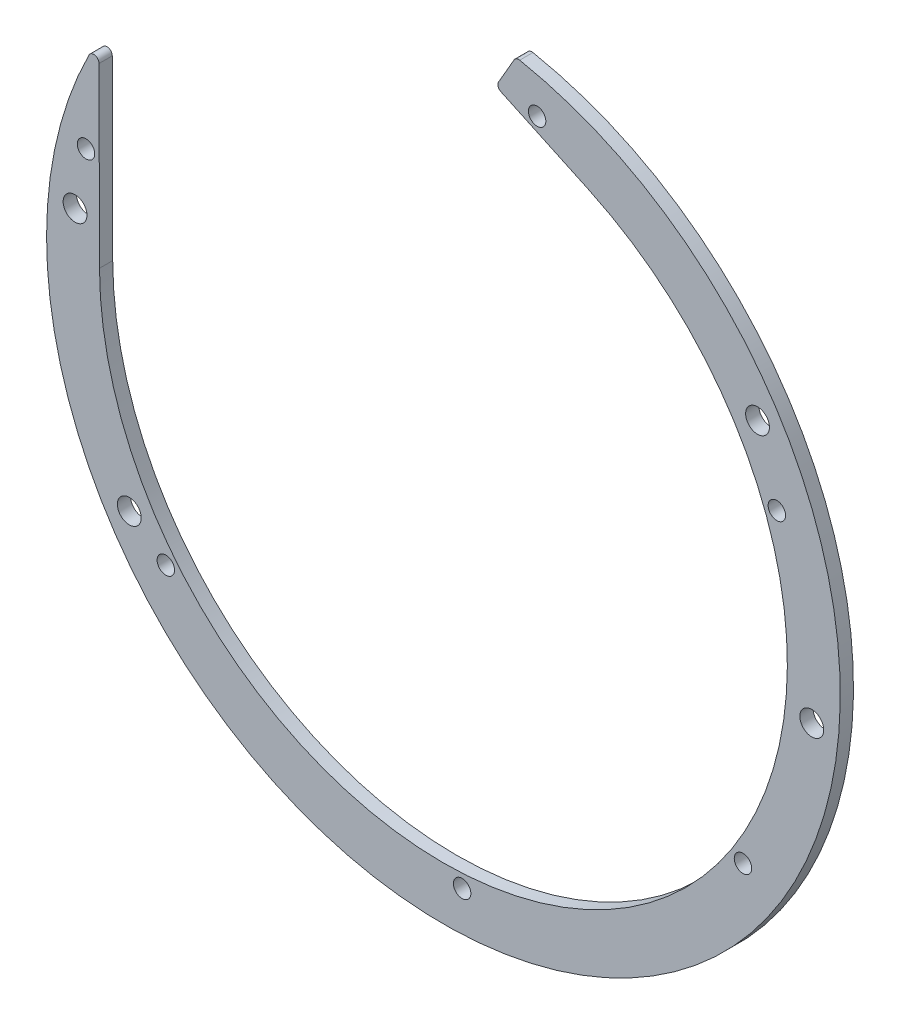
ISO-10303-21;
HEADER;
FILE_DESCRIPTION(('STEP AP214'),'2;1');
FILE_NAME('part.step','',(''),(''),'','','');
FILE_SCHEMA(('AUTOMOTIVE_DESIGN { 1 0 10303 214 1 1 1 1 }'));
ENDSEC;
DATA;
#1=APPLICATION_CONTEXT('core data for automotive mechanical design processes');
#2=APPLICATION_PROTOCOL_DEFINITION('international standard','automotive_design',2000,#1);
#3=PRODUCT_CONTEXT('',#1,'mechanical');
#4=PRODUCT('Part','Part','',(#3));
#5=PRODUCT_RELATED_PRODUCT_CATEGORY('part','',(#4));
#6=PRODUCT_DEFINITION_FORMATION('','',#4);
#7=PRODUCT_DEFINITION_CONTEXT('part definition',#1,'design');
#8=PRODUCT_DEFINITION('design','',#6,#7);
#9=PRODUCT_DEFINITION_SHAPE('','',#8);
#10=(LENGTH_UNIT() NAMED_UNIT(*) SI_UNIT(.MILLI.,.METRE.));
#11=(NAMED_UNIT(*) PLANE_ANGLE_UNIT() SI_UNIT($,.RADIAN.));
#12=(NAMED_UNIT(*) SI_UNIT($,.STERADIAN.) SOLID_ANGLE_UNIT());
#13=UNCERTAINTY_MEASURE_WITH_UNIT(LENGTH_MEASURE(1.E-05),#10,'distance_accuracy_value','');
#14=(GEOMETRIC_REPRESENTATION_CONTEXT(3) GLOBAL_UNCERTAINTY_ASSIGNED_CONTEXT((#13)) GLOBAL_UNIT_ASSIGNED_CONTEXT((#10,
#11,#12)) REPRESENTATION_CONTEXT('',''));
#15=CARTESIAN_POINT('',(0.,0.,0.));
#16=DIRECTION('',(0.,0.,1.));
#17=DIRECTION('',(1.,0.,0.));
#18=AXIS2_PLACEMENT_3D('',#15,#16,#17);
#19=CARTESIAN_POINT('',(27.4277530561864,147.471076358345,0.));
#20=DIRECTION('',(0.866025403784439,-0.5,0.));
#21=DIRECTION('',(-0.5,-0.866025403784439,0.));
#22=AXIS2_PLACEMENT_3D('',#19,#20,#21);
#23=PLANE('',#22);
#24=DIRECTION('',(0.,0.,-1.));
#25=VECTOR('',#24,1.);
#26=CARTESIAN_POINT('',(20.8671165029872,136.107720518211,0.));
#27=LINE('',#26,#25);
#28=CARTESIAN_POINT('',(20.8671165029872,136.107720518211,5.));
#29=VERTEX_POINT('',#28);
#30=CARTESIAN_POINT('',(20.8671165029872,136.107720518211,0.));
#31=VERTEX_POINT('',#30);
#32=EDGE_CURVE('E11',#29,#31,#27,.T.);
#33=ORIENTED_EDGE('',*,*,#32,.F.);
#34=DIRECTION('',(-0.5,-0.866025403784439,0.));
#35=VECTOR('',#34,1.);
#36=CARTESIAN_POINT('',(27.4277530561864,147.471076358345,5.));
#37=LINE('',#36,#35);
#38=CARTESIAN_POINT('',(26.7169808472667,146.239982779888,5.));
#39=VERTEX_POINT('',#38);
#40=EDGE_CURVE('E110',#39,#29,#37,.T.);
#41=ORIENTED_EDGE('',*,*,#40,.F.);
#42=DIRECTION('',(0.,0.,-1.));
#43=VECTOR('',#42,1.);
#44=CARTESIAN_POINT('',(26.7169808472667,146.239982779888,0.));
#45=LINE('',#44,#43);
#46=CARTESIAN_POINT('',(26.7169808472667,146.239982779888,0.));
#47=VERTEX_POINT('',#46);
#48=EDGE_CURVE('E53',#39,#47,#45,.T.);
#49=ORIENTED_EDGE('',*,*,#48,.T.);
#50=DIRECTION('',(-0.5,-0.866025403784439,0.));
#51=VECTOR('',#50,1.);
#52=CARTESIAN_POINT('',(27.4277530561864,147.471076358345,0.));
#53=LINE('',#52,#51);
#54=EDGE_CURVE('E162',#47,#31,#53,.T.);
#55=ORIENTED_EDGE('',*,*,#54,.T.);
#56=EDGE_LOOP('',(#33,#41,#49,#55));
#57=FACE_BOUND('',#56,.T.);
#58=ADVANCED_FACE('F43',(#57),#23,.F.);
#59=CARTESIAN_POINT('',(28.4490316548356,145.239982779888,0.));
#60=DIRECTION('',(0.,0.,-1.));
#61=DIRECTION('',(-1.,0.,0.));
#62=AXIS2_PLACEMENT_3D('',#59,#60,#61);
#63=CYLINDRICAL_SURFACE('',#62,2.);
#64=ORIENTED_EDGE('',*,*,#48,.F.);
#65=CARTESIAN_POINT('',(28.4490316548356,145.239982779888,5.));
#66=DIRECTION('',(0.,0.,-1.));
#67=DIRECTION('',(-1.,0.,0.));
#68=AXIS2_PLACEMENT_3D('',#65,#66,#67);
#69=CIRCLE('',#68,2.);
#70=CARTESIAN_POINT('',(28.8334780285495,147.202685249887,5.));
#71=VERTEX_POINT('',#70);
#72=EDGE_CURVE('E140',#39,#71,#69,.T.);
#73=ORIENTED_EDGE('',*,*,#72,.T.);
#74=DIRECTION('',(0.,0.,-1.));
#75=VECTOR('',#74,1.);
#76=CARTESIAN_POINT('',(28.8334780285495,147.202685249887,0.));
#77=LINE('',#76,#75);
#78=CARTESIAN_POINT('',(28.8334780285495,147.202685249887,0.));
#79=VERTEX_POINT('',#78);
#80=EDGE_CURVE('E155',#71,#79,#77,.T.);
#81=ORIENTED_EDGE('',*,*,#80,.T.);
#82=CARTESIAN_POINT('',(28.4490316548356,145.239982779888,0.));
#83=DIRECTION('',(0.,0.,-1.));
#84=DIRECTION('',(-1.,0.,0.));
#85=AXIS2_PLACEMENT_3D('',#82,#83,#84);
#86=CIRCLE('',#85,2.);
#87=EDGE_CURVE('E171',#47,#79,#86,.T.);
#88=ORIENTED_EDGE('',*,*,#87,.F.);
#89=EDGE_LOOP('',(#64,#73,#81,#88));
#90=FACE_BOUND('',#89,.T.);
#91=ADVANCED_FACE('F175',(#90),#63,.T.);
#92=CARTESIAN_POINT('',(0.,0.,0.));
#93=DIRECTION('',(0.,0.,-1.));
#94=DIRECTION('',(-1.,0.,0.));
#95=AXIS2_PLACEMENT_3D('',#92,#93,#94);
#96=CYLINDRICAL_SURFACE('',#95,150.);
#97=ORIENTED_EDGE('',*,*,#80,.F.);
#98=CARTESIAN_POINT('',(0.,0.,5.));
#99=DIRECTION('',(0.,0.,1.));
#100=DIRECTION('',(1.,0.,0.));
#101=AXIS2_PLACEMENT_3D('',#98,#99,#100);
#102=CIRCLE('',#101,150.);
#103=CARTESIAN_POINT('',(-133.953391528007,67.5017695926886,5.00000000000001));
#104=VERTEX_POINT('',#103);
#105=EDGE_CURVE('E136',#104,#71,#102,.T.);
#106=ORIENTED_EDGE('',*,*,#105,.F.);
#107=DIRECTION('',(0.,0.,-1.));
#108=VECTOR('',#107,1.);
#109=CARTESIAN_POINT('',(-133.953391528007,67.5017695926886,0.));
#110=LINE('',#109,#108);
#111=CARTESIAN_POINT('',(-133.953391528007,67.5017695926886,0.));
#112=VERTEX_POINT('',#111);
#113=EDGE_CURVE('E152',#104,#112,#110,.T.);
#114=ORIENTED_EDGE('',*,*,#113,.T.);
#115=CARTESIAN_POINT('',(0.,0.,0.));
#116=DIRECTION('',(0.,0.,1.));
#117=DIRECTION('',(-1.,0.,0.));
#118=AXIS2_PLACEMENT_3D('',#115,#116,#117);
#119=CIRCLE('',#118,150.);
#120=EDGE_CURVE('E177',#112,#79,#119,.T.);
#121=ORIENTED_EDGE('',*,*,#120,.T.);
#122=EDGE_LOOP('',(#97,#106,#114,#121));
#123=FACE_BOUND('',#122,.T.);
#124=ADVANCED_FACE('F252',(#123),#96,.T.);
#125=CARTESIAN_POINT('',(-132.167346307634,66.6017459981194,0.));
#126=DIRECTION('',(0.,0.,-1.));
#127=DIRECTION('',(-1.,0.,0.));
#128=AXIS2_PLACEMENT_3D('',#125,#126,#127);
#129=CYLINDRICAL_SURFACE('',#128,2.);
#130=ORIENTED_EDGE('',*,*,#113,.F.);
#131=CARTESIAN_POINT('',(-132.167346307634,66.6017459981194,5.));
#132=DIRECTION('',(0.,0.,-1.));
#133=DIRECTION('',(-1.,0.,0.));
#134=AXIS2_PLACEMENT_3D('',#131,#132,#133);
#135=CIRCLE('',#134,2.);
#136=CARTESIAN_POINT('',(-130.167352589726,66.6067588145679,5.00000000000001));
#137=VERTEX_POINT('',#136);
#138=EDGE_CURVE('E132',#104,#137,#135,.T.);
#139=ORIENTED_EDGE('',*,*,#138,.T.);
#140=DIRECTION('',(0.,0.,-1.));
#141=VECTOR('',#140,1.);
#142=CARTESIAN_POINT('',(-130.167352589726,66.6067588145679,0.));
#143=LINE('',#142,#141);
#144=CARTESIAN_POINT('',(-130.167352589726,66.6067588145679,0.));
#145=VERTEX_POINT('',#144);
#146=EDGE_CURVE('E149',#137,#145,#143,.T.);
#147=ORIENTED_EDGE('',*,*,#146,.T.);
#148=CARTESIAN_POINT('',(-132.167346307634,66.6017459981194,0.));
#149=DIRECTION('',(0.,0.,-1.));
#150=DIRECTION('',(-1.,0.,0.));
#151=AXIS2_PLACEMENT_3D('',#148,#149,#150);
#152=CIRCLE('',#151,2.);
#153=EDGE_CURVE('E181',#112,#145,#152,.T.);
#154=ORIENTED_EDGE('',*,*,#153,.F.);
#155=EDGE_LOOP('',(#130,#139,#147,#154));
#156=FACE_BOUND('',#155,.T.);
#157=ADVANCED_FACE('F257',(#156),#129,.T.);
#158=CARTESIAN_POINT('',(-130.187154080944,74.5070796119715,0.));
#159=DIRECTION('',(-0.999996858953974,-0.00250640822420056,0.));
#160=DIRECTION('',(-0.00250640822420056,0.999996858953974,0.));
#161=AXIS2_PLACEMENT_3D('',#158,#159,#160);
#162=PLANE('',#161);
#163=ORIENTED_EDGE('',*,*,#146,.F.);
#164=DIRECTION('',(-0.00250640822420056,0.999996858953974,0.));
#165=VECTOR('',#164,1.);
#166=CARTESIAN_POINT('',(-130.187154080944,74.5070796119715,5.));
#167=LINE('',#166,#165);
#168=CARTESIAN_POINT('',(-129.999591664017,-0.325833069146075,5.00000000000001));
#169=VERTEX_POINT('',#168);
#170=EDGE_CURVE('E128',#169,#137,#167,.T.);
#171=ORIENTED_EDGE('',*,*,#170,.F.);
#172=DIRECTION('',(0.,0.,-1.));
#173=VECTOR('',#172,1.);
#174=CARTESIAN_POINT('',(-129.999591664017,-0.325833069146075,0.));
#175=LINE('',#174,#173);
#176=CARTESIAN_POINT('',(-129.999591664017,-0.325833069146075,0.));
#177=VERTEX_POINT('',#176);
#178=EDGE_CURVE('E147',#169,#177,#175,.T.);
#179=ORIENTED_EDGE('',*,*,#178,.T.);
#180=DIRECTION('',(-0.00250640822420056,0.999996858953974,0.));
#181=VECTOR('',#180,1.);
#182=CARTESIAN_POINT('',(-130.187154080944,74.5070796119715,0.));
#183=LINE('',#182,#181);
#184=EDGE_CURVE('E188',#177,#145,#183,.T.);
#185=ORIENTED_EDGE('',*,*,#184,.T.);
#186=EDGE_LOOP('',(#163,#171,#179,#185));
#187=FACE_BOUND('',#186,.T.);
#188=ADVANCED_FACE('F261',(#187),#162,.F.);
#189=CARTESIAN_POINT('',(0.,0.,0.));
#190=DIRECTION('',(0.,0.,-1.));
#191=DIRECTION('',(-1.,0.,0.));
#192=AXIS2_PLACEMENT_3D('',#189,#190,#191);
#193=CYLINDRICAL_SURFACE('',#192,130.);
#194=ORIENTED_EDGE('',*,*,#178,.F.);
#195=CARTESIAN_POINT('',(0.,0.,5.));
#196=DIRECTION('',(0.,0.,-1.));
#197=DIRECTION('',(-1.,0.,0.));
#198=AXIS2_PLACEMENT_3D('',#195,#196,#197);
#199=CIRCLE('',#198,130.);
#200=CARTESIAN_POINT('',(54.940374026291,117.820012314764,5.));
#201=VERTEX_POINT('',#200);
#202=EDGE_CURVE('E124',#201,#169,#199,.T.);
#203=ORIENTED_EDGE('',*,*,#202,.F.);
#204=DIRECTION('',(0.,0.,-1.));
#205=VECTOR('',#204,1.);
#206=CARTESIAN_POINT('',(54.940374026291,117.820012314764,0.));
#207=LINE('',#206,#205);
#208=CARTESIAN_POINT('',(54.940374026291,117.820012314764,0.));
#209=VERTEX_POINT('',#208);
#210=EDGE_CURVE('E61',#201,#209,#207,.T.);
#211=ORIENTED_EDGE('',*,*,#210,.T.);
#212=CARTESIAN_POINT('',(0.,0.,0.));
#213=DIRECTION('',(0.,0.,-1.));
#214=DIRECTION('',(-1.,0.,0.));
#215=AXIS2_PLACEMENT_3D('',#212,#213,#214);
#216=CIRCLE('',#215,130.);
#217=EDGE_CURVE('E103',#209,#177,#216,.T.);
#218=ORIENTED_EDGE('',*,*,#217,.T.);
#219=EDGE_LOOP('',(#194,#203,#211,#218));
#220=FACE_BOUND('',#219,.T.);
#221=ADVANCED_FACE('F265',(#220),#193,.F.);
#222=CARTESIAN_POINT('',(54.940374026291,117.820012314764,0.));
#223=DIRECTION('',(0.4226182617407,0.90630778703665,0.));
#224=DIRECTION('',(0.90630778703665,-0.4226182617407,0.));
#225=AXIS2_PLACEMENT_3D('',#222,#223,#224);
#226=PLANE('',#225);
#227=ORIENTED_EDGE('',*,*,#210,.F.);
#228=DIRECTION('',(0.90630778703665,-0.4226182617407,0.));
#229=VECTOR('',#228,1.);
#230=CARTESIAN_POINT('',(54.940374026291,117.820012314764,4.99999999999994));
#231=LINE('',#230,#229);
#232=CARTESIAN_POINT('',(21.7539307870747,133.295104944137,5.));
#233=VERTEX_POINT('',#232);
#234=EDGE_CURVE('E108',#233,#201,#231,.T.);
#235=ORIENTED_EDGE('',*,*,#234,.F.);
#236=DIRECTION('',(0.,0.,-1.));
#237=VECTOR('',#236,1.);
#238=CARTESIAN_POINT('',(21.7539307870747,133.295104944137,0.));
#239=LINE('',#238,#237);
#240=CARTESIAN_POINT('',(21.7539307870747,133.295104944137,0.));
#241=VERTEX_POINT('',#240);
#242=EDGE_CURVE('E47',#233,#241,#239,.T.);
#243=ORIENTED_EDGE('',*,*,#242,.T.);
#244=DIRECTION('',(0.90630778703665,-0.4226182617407,0.));
#245=VECTOR('',#244,1.);
#246=CARTESIAN_POINT('',(54.940374026291,117.820012314764,0.));
#247=LINE('',#246,#245);
#248=EDGE_CURVE('E375',#241,#209,#247,.T.);
#249=ORIENTED_EDGE('',*,*,#248,.T.);
#250=EDGE_LOOP('',(#227,#235,#243,#249));
#251=FACE_BOUND('',#250,.T.);
#252=ADVANCED_FACE('F113',(#251),#226,.F.);
#253=CARTESIAN_POINT('',(-139.233065351558,14.633984857472,0.));
#254=DIRECTION('',(0.,0.,-1.));
#255=DIRECTION('',(-1.,0.,0.));
#256=AXIS2_PLACEMENT_3D('',#253,#254,#255);
#257=CYLINDRICAL_SURFACE('',#256,4.5);
#258=CARTESIAN_POINT('',(-139.233065351558,14.633984857472,0.));
#259=DIRECTION('',(0.,0.,-1.));
#260=DIRECTION('',(-1.,0.,0.));
#261=AXIS2_PLACEMENT_3D('',#258,#259,#260);
#262=CIRCLE('',#261,4.5);
#263=CARTESIAN_POINT('',(-143.733065351558,14.633984857472,0.));
#264=VERTEX_POINT('',#263);
#265=EDGE_CURVE('E127',#264,#264,#262,.T.);
#266=ORIENTED_EDGE('',*,*,#265,.T.);
#267=EDGE_LOOP('',(#266));
#268=FACE_BOUND('',#267,.T.);
#269=CARTESIAN_POINT('',(-139.233065351558,14.633984857472,5.));
#270=DIRECTION('',(0.,0.,-1.));
#271=DIRECTION('',(-1.,0.,0.));
#272=AXIS2_PLACEMENT_3D('',#269,#270,#271);
#273=CIRCLE('',#272,4.5);
#274=CARTESIAN_POINT('',(-143.733065351558,14.633984857472,5.));
#275=VERTEX_POINT('',#274);
#276=EDGE_CURVE('E194',#275,#275,#273,.T.);
#277=ORIENTED_EDGE('',*,*,#276,.F.);
#278=EDGE_LOOP('',(#277));
#279=FACE_BOUND('',#278,.T.);
#280=ADVANCED_FACE('F270',(#268,#279),#257,.F.);
#281=CARTESIAN_POINT('',(-118.7267334619,-74.1886969926484,0.));
#282=DIRECTION('',(0.,0.,-1.));
#283=DIRECTION('',(-1.,0.,0.));
#284=AXIS2_PLACEMENT_3D('',#281,#282,#283);
#285=CYLINDRICAL_SURFACE('',#284,4.5);
#286=CARTESIAN_POINT('',(-118.7267334619,-74.1886969926484,0.));
#287=DIRECTION('',(0.,0.,-1.));
#288=DIRECTION('',(-1.,0.,0.));
#289=AXIS2_PLACEMENT_3D('',#286,#287,#288);
#290=CIRCLE('',#289,4.5);
#291=CARTESIAN_POINT('',(-123.2267334619,-74.1886969926484,0.));
#292=VERTEX_POINT('',#291);
#293=EDGE_CURVE('E346',#292,#292,#290,.T.);
#294=ORIENTED_EDGE('',*,*,#293,.T.);
#295=EDGE_LOOP('',(#294));
#296=FACE_BOUND('',#295,.T.);
#297=CARTESIAN_POINT('',(-118.7267334619,-74.1886969926484,5.));
#298=DIRECTION('',(0.,0.,-1.));
#299=DIRECTION('',(-1.,0.,0.));
#300=AXIS2_PLACEMENT_3D('',#297,#298,#299);
#301=CIRCLE('',#300,4.5);
#302=CARTESIAN_POINT('',(-123.2267334619,-74.1886969926484,5.));
#303=VERTEX_POINT('',#302);
#304=EDGE_CURVE('E198',#303,#303,#301,.T.);
#305=ORIENTED_EDGE('',*,*,#304,.F.);
#306=EDGE_LOOP('',(#305));
#307=FACE_BOUND('',#306,.T.);
#308=ADVANCED_FACE('F274',(#296,#307),#285,.F.);
#309=CARTESIAN_POINT('',(139.233065351558,-14.633984857472,0.));
#310=DIRECTION('',(0.,0.,-1.));
#311=DIRECTION('',(-1.,0.,0.));
#312=AXIS2_PLACEMENT_3D('',#309,#310,#311);
#313=CYLINDRICAL_SURFACE('',#312,4.5);
#314=CARTESIAN_POINT('',(139.233065351558,-14.633984857472,0.));
#315=DIRECTION('',(0.,0.,-1.));
#316=DIRECTION('',(-1.,0.,0.));
#317=AXIS2_PLACEMENT_3D('',#314,#315,#316);
#318=CIRCLE('',#317,4.5);
#319=CARTESIAN_POINT('',(134.733065351558,-14.633984857472,0.));
#320=VERTEX_POINT('',#319);
#321=EDGE_CURVE('E350',#320,#320,#318,.T.);
#322=ORIENTED_EDGE('',*,*,#321,.T.);
#323=EDGE_LOOP('',(#322));
#324=FACE_BOUND('',#323,.T.);
#325=CARTESIAN_POINT('',(139.233065351558,-14.633984857472,5.));
#326=DIRECTION('',(0.,0.,-1.));
#327=DIRECTION('',(-1.,0.,0.));
#328=AXIS2_PLACEMENT_3D('',#325,#326,#327);
#329=CIRCLE('',#328,4.5);
#330=CARTESIAN_POINT('',(134.733065351558,-14.633984857472,5.));
#331=VERTEX_POINT('',#330);
#332=EDGE_CURVE('E202',#331,#331,#329,.T.);
#333=ORIENTED_EDGE('',*,*,#332,.F.);
#334=EDGE_LOOP('',(#333));
#335=FACE_BOUND('',#334,.T.);
#336=ADVANCED_FACE('F280',(#324,#335),#313,.F.);
#337=CARTESIAN_POINT('',(118.7267334619,74.1886969926484,0.));
#338=DIRECTION('',(0.,0.,-1.));
#339=DIRECTION('',(-1.,0.,0.));
#340=AXIS2_PLACEMENT_3D('',#337,#338,#339);
#341=CYLINDRICAL_SURFACE('',#340,4.5);
#342=CARTESIAN_POINT('',(118.7267334619,74.1886969926484,0.));
#343=DIRECTION('',(0.,0.,-1.));
#344=DIRECTION('',(-1.,0.,0.));
#345=AXIS2_PLACEMENT_3D('',#342,#343,#344);
#346=CIRCLE('',#345,4.5);
#347=CARTESIAN_POINT('',(114.2267334619,74.1886969926484,0.));
#348=VERTEX_POINT('',#347);
#349=EDGE_CURVE('E354',#348,#348,#346,.T.);
#350=ORIENTED_EDGE('',*,*,#349,.T.);
#351=EDGE_LOOP('',(#350));
#352=FACE_BOUND('',#351,.T.);
#353=CARTESIAN_POINT('',(118.7267334619,74.1886969926484,5.));
#354=DIRECTION('',(0.,0.,-1.));
#355=DIRECTION('',(-1.,0.,0.));
#356=AXIS2_PLACEMENT_3D('',#353,#354,#355);
#357=CIRCLE('',#356,4.5);
#358=CARTESIAN_POINT('',(114.2267334619,74.1886969926484,5.));
#359=VERTEX_POINT('',#358);
#360=EDGE_CURVE('E206',#359,#359,#357,.T.);
#361=ORIENTED_EDGE('',*,*,#360,.F.);
#362=EDGE_LOOP('',(#361));
#363=FACE_BOUND('',#362,.T.);
#364=ADVANCED_FACE('F290',(#352,#363),#341,.F.);
#365=CARTESIAN_POINT('',(126.033357577122,48.379673188617,0.));
#366=DIRECTION('',(0.,0.,-1.));
#367=DIRECTION('',(-1.,0.,0.));
#368=AXIS2_PLACEMENT_3D('',#365,#366,#367);
#369=CYLINDRICAL_SURFACE('',#368,3.3);
#370=CARTESIAN_POINT('',(126.033357577122,48.379673188617,0.));
#371=DIRECTION('',(0.,0.,-1.));
#372=DIRECTION('',(-1.,0.,0.));
#373=AXIS2_PLACEMENT_3D('',#370,#371,#372);
#374=CIRCLE('',#373,3.3);
#375=CARTESIAN_POINT('',(122.733357577122,48.379673188617,0.));
#376=VERTEX_POINT('',#375);
#377=EDGE_CURVE('E358',#376,#376,#374,.T.);
#378=ORIENTED_EDGE('',*,*,#377,.T.);
#379=EDGE_LOOP('',(#378));
#380=FACE_BOUND('',#379,.T.);
#381=CARTESIAN_POINT('',(126.033357577122,48.379673188617,5.00000000000006));
#382=DIRECTION('',(0.,0.,-1.));
#383=DIRECTION('',(-1.,0.,0.));
#384=AXIS2_PLACEMENT_3D('',#381,#382,#383);
#385=CIRCLE('',#384,3.3);
#386=CARTESIAN_POINT('',(122.733357577122,48.379673188617,5.00000000000006));
#387=VERTEX_POINT('',#386);
#388=EDGE_CURVE('E210',#387,#387,#385,.T.);
#389=ORIENTED_EDGE('',*,*,#388,.F.);
#390=EDGE_LOOP('',(#389));
#391=FACE_BOUND('',#390,.T.);
#392=ADVANCED_FACE('F294',(#380,#391),#369,.F.);
#393=CARTESIAN_POINT('',(35.411080451429,132.155951395642,0.));
#394=DIRECTION('',(0.,0.,-1.));
#395=DIRECTION('',(-1.,0.,0.));
#396=AXIS2_PLACEMENT_3D('',#393,#394,#395);
#397=CYLINDRICAL_SURFACE('',#396,3.3);
#398=CARTESIAN_POINT('',(35.411080451429,132.155951395642,0.));
#399=DIRECTION('',(0.,0.,-1.));
#400=DIRECTION('',(-1.,0.,0.));
#401=AXIS2_PLACEMENT_3D('',#398,#399,#400);
#402=CIRCLE('',#401,3.3);
#403=CARTESIAN_POINT('',(32.111080451429,132.155951395642,0.));
#404=VERTEX_POINT('',#403);
#405=EDGE_CURVE('E362',#404,#404,#402,.T.);
#406=ORIENTED_EDGE('',*,*,#405,.T.);
#407=EDGE_LOOP('',(#406));
#408=FACE_BOUND('',#407,.T.);
#409=CARTESIAN_POINT('',(35.411080451429,132.155951395642,5.));
#410=DIRECTION('',(0.,0.,-1.));
#411=DIRECTION('',(-1.,0.,0.));
#412=AXIS2_PLACEMENT_3D('',#409,#410,#411);
#413=CIRCLE('',#412,3.3);
#414=CARTESIAN_POINT('',(32.111080451429,132.155951395642,5.));
#415=VERTEX_POINT('',#414);
#416=EDGE_CURVE('E214',#415,#415,#413,.T.);
#417=ORIENTED_EDGE('',*,*,#416,.F.);
#418=EDGE_LOOP('',(#417));
#419=FACE_BOUND('',#418,.T.);
#420=ADVANCED_FACE('F298',(#408,#419),#397,.F.);
#421=CARTESIAN_POINT('',(113.220526672633,-73.5262697270275,0.));
#422=DIRECTION('',(0.,0.,-1.));
#423=DIRECTION('',(-1.,0.,0.));
#424=AXIS2_PLACEMENT_3D('',#421,#422,#423);
#425=CYLINDRICAL_SURFACE('',#424,3.3);
#426=CARTESIAN_POINT('',(113.220526672633,-73.5262697270275,0.));
#427=DIRECTION('',(0.,0.,-1.));
#428=DIRECTION('',(-1.,0.,0.));
#429=AXIS2_PLACEMENT_3D('',#426,#427,#428);
#430=CIRCLE('',#429,3.3);
#431=CARTESIAN_POINT('',(109.920526672633,-73.5262697270275,0.));
#432=VERTEX_POINT('',#431);
#433=EDGE_CURVE('E310',#432,#432,#430,.T.);
#434=ORIENTED_EDGE('',*,*,#433,.T.);
#435=EDGE_LOOP('',(#434));
#436=FACE_BOUND('',#435,.T.);
#437=CARTESIAN_POINT('',(113.220526672633,-73.5262697270275,4.99999999999994));
#438=DIRECTION('',(0.,0.,-1.));
#439=DIRECTION('',(-1.,0.,0.));
#440=AXIS2_PLACEMENT_3D('',#437,#438,#439);
#441=CIRCLE('',#440,3.3);
#442=CARTESIAN_POINT('',(109.920526672633,-73.5262697270275,4.99999999999994));
#443=VERTEX_POINT('',#442);
#444=EDGE_CURVE('E218',#443,#443,#441,.T.);
#445=ORIENTED_EDGE('',*,*,#444,.F.);
#446=EDGE_LOOP('',(#445));
#447=FACE_BOUND('',#446,.T.);
#448=ADVANCED_FACE('F244',(#436,#447),#425,.F.);
#449=CARTESIAN_POINT('',(7.06535409279951,-134.814987191867,0.));
#450=DIRECTION('',(0.,0.,-1.));
#451=DIRECTION('',(-1.,0.,0.));
#452=AXIS2_PLACEMENT_3D('',#449,#450,#451);
#453=CYLINDRICAL_SURFACE('',#452,3.3);
#454=CARTESIAN_POINT('',(7.06535409279951,-134.814987191867,0.));
#455=DIRECTION('',(0.,0.,-1.));
#456=DIRECTION('',(-1.,0.,0.));
#457=AXIS2_PLACEMENT_3D('',#454,#455,#456);
#458=CIRCLE('',#457,3.3);
#459=CARTESIAN_POINT('',(3.76535409279952,-134.814987191867,0.));
#460=VERTEX_POINT('',#459);
#461=EDGE_CURVE('E367',#460,#460,#458,.T.);
#462=ORIENTED_EDGE('',*,*,#461,.T.);
#463=EDGE_LOOP('',(#462));
#464=FACE_BOUND('',#463,.T.);
#465=CARTESIAN_POINT('',(7.06535409279951,-134.814987191867,5.));
#466=DIRECTION('',(0.,0.,-1.));
#467=DIRECTION('',(-1.,0.,0.));
#468=AXIS2_PLACEMENT_3D('',#465,#466,#467);
#469=CIRCLE('',#468,3.3);
#470=CARTESIAN_POINT('',(3.76535409279952,-134.814987191867,5.));
#471=VERTEX_POINT('',#470);
#472=EDGE_CURVE('E222',#471,#471,#469,.T.);
#473=ORIENTED_EDGE('',*,*,#472,.F.);
#474=EDGE_LOOP('',(#473));
#475=FACE_BOUND('',#474,.T.);
#476=ADVANCED_FACE('F235',(#464,#475),#453,.F.);
#477=CARTESIAN_POINT('',(-104.914704796689,-84.9582527917303,0.));
#478=DIRECTION('',(0.,0.,-1.));
#479=DIRECTION('',(-1.,0.,0.));
#480=AXIS2_PLACEMENT_3D('',#477,#478,#479);
#481=CYLINDRICAL_SURFACE('',#480,3.3);
#482=CARTESIAN_POINT('',(-104.914704796689,-84.9582527917303,0.));
#483=DIRECTION('',(0.,0.,-1.));
#484=DIRECTION('',(-1.,0.,0.));
#485=AXIS2_PLACEMENT_3D('',#482,#483,#484);
#486=CIRCLE('',#485,3.3);
#487=CARTESIAN_POINT('',(-108.214704796689,-84.9582527917303,0.));
#488=VERTEX_POINT('',#487);
#489=EDGE_CURVE('E370',#488,#488,#486,.T.);
#490=ORIENTED_EDGE('',*,*,#489,.T.);
#491=EDGE_LOOP('',(#490));
#492=FACE_BOUND('',#491,.T.);
#493=CARTESIAN_POINT('',(-104.914704796689,-84.9582527917303,4.99999999999994));
#494=DIRECTION('',(0.,0.,-1.));
#495=DIRECTION('',(-1.,0.,0.));
#496=AXIS2_PLACEMENT_3D('',#493,#494,#495);
#497=CIRCLE('',#496,3.3);
#498=CARTESIAN_POINT('',(-108.214704796689,-84.9582527917303,4.99999999999994));
#499=VERTEX_POINT('',#498);
#500=EDGE_CURVE('E120',#499,#499,#497,.T.);
#501=ORIENTED_EDGE('',*,*,#500,.F.);
#502=EDGE_LOOP('',(#501));
#503=FACE_BOUND('',#502,.T.);
#504=ADVANCED_FACE('F232',(#492,#503),#481,.F.);
#505=CARTESIAN_POINT('',(-135.091150201133,36.1975646009845,0.));
#506=DIRECTION('',(0.,0.,-1.));
#507=DIRECTION('',(-1.,0.,0.));
#508=AXIS2_PLACEMENT_3D('',#505,#506,#507);
#509=CYLINDRICAL_SURFACE('',#508,3.3);
#510=CARTESIAN_POINT('',(-135.091150201133,36.1975646009845,0.));
#511=DIRECTION('',(0.,0.,-1.));
#512=DIRECTION('',(-1.,0.,0.));
#513=AXIS2_PLACEMENT_3D('',#510,#511,#512);
#514=CIRCLE('',#513,3.3);
#515=CARTESIAN_POINT('',(-138.391150201132,36.1975646009845,0.));
#516=VERTEX_POINT('',#515);
#517=EDGE_CURVE('E373',#516,#516,#514,.T.);
#518=ORIENTED_EDGE('',*,*,#517,.T.);
#519=EDGE_LOOP('',(#518));
#520=FACE_BOUND('',#519,.T.);
#521=CARTESIAN_POINT('',(-135.091150201133,36.1975646009845,5.));
#522=DIRECTION('',(0.,0.,-1.));
#523=DIRECTION('',(-1.,0.,0.));
#524=AXIS2_PLACEMENT_3D('',#521,#522,#523);
#525=CIRCLE('',#524,3.3);
#526=CARTESIAN_POINT('',(-138.391150201132,36.1975646009845,5.));
#527=VERTEX_POINT('',#526);
#528=EDGE_CURVE('E115',#527,#527,#525,.T.);
#529=ORIENTED_EDGE('',*,*,#528,.F.);
#530=EDGE_LOOP('',(#529));
#531=FACE_BOUND('',#530,.T.);
#532=ADVANCED_FACE('F234',(#520,#531),#509,.F.);
#533=CARTESIAN_POINT('',(22.5991673105561,135.107720518211,0.));
#534=DIRECTION('',(0.,0.,-1.));
#535=DIRECTION('',(-1.,0.,0.));
#536=AXIS2_PLACEMENT_3D('',#533,#534,#535);
#537=CYLINDRICAL_SURFACE('',#536,2.);
#538=CARTESIAN_POINT('',(22.5991673105561,135.107720518211,5.));
#539=DIRECTION('',(0.,0.,-1.));
#540=DIRECTION('',(-1.,0.,0.));
#541=AXIS2_PLACEMENT_3D('',#538,#539,#540);
#542=CIRCLE('',#541,2.);
#543=EDGE_CURVE('E97',#233,#29,#542,.T.);
#544=ORIENTED_EDGE('',*,*,#543,.T.);
#545=ORIENTED_EDGE('',*,*,#32,.T.);
#546=CARTESIAN_POINT('',(22.5991673105561,135.107720518211,0.));
#547=DIRECTION('',(0.,0.,-1.));
#548=DIRECTION('',(-1.,0.,0.));
#549=AXIS2_PLACEMENT_3D('',#546,#547,#548);
#550=CIRCLE('',#549,2.);
#551=EDGE_CURVE('E99',#241,#31,#550,.T.);
#552=ORIENTED_EDGE('',*,*,#551,.F.);
#553=ORIENTED_EDGE('',*,*,#242,.F.);
#554=EDGE_LOOP('',(#544,#545,#552,#553));
#555=FACE_BOUND('',#554,.T.);
#556=ADVANCED_FACE('F45',(#555),#537,.T.);
#557=CARTESIAN_POINT('',(0.,0.,0.));
#558=DIRECTION('',(0.,0.,-1.));
#559=DIRECTION('',(-1.,0.,0.));
#560=AXIS2_PLACEMENT_3D('',#557,#558,#559);
#561=PLANE('',#560);
#562=ORIENTED_EDGE('',*,*,#265,.F.);
#563=EDGE_LOOP('',(#562));
#564=FACE_BOUND('',#563,.T.);
#565=ORIENTED_EDGE('',*,*,#293,.F.);
#566=EDGE_LOOP('',(#565));
#567=FACE_BOUND('',#566,.T.);
#568=ORIENTED_EDGE('',*,*,#321,.F.);
#569=EDGE_LOOP('',(#568));
#570=FACE_BOUND('',#569,.T.);
#571=ORIENTED_EDGE('',*,*,#349,.F.);
#572=EDGE_LOOP('',(#571));
#573=FACE_BOUND('',#572,.T.);
#574=ORIENTED_EDGE('',*,*,#377,.F.);
#575=EDGE_LOOP('',(#574));
#576=FACE_BOUND('',#575,.T.);
#577=ORIENTED_EDGE('',*,*,#405,.F.);
#578=EDGE_LOOP('',(#577));
#579=FACE_BOUND('',#578,.T.);
#580=ORIENTED_EDGE('',*,*,#433,.F.);
#581=EDGE_LOOP('',(#580));
#582=FACE_BOUND('',#581,.T.);
#583=ORIENTED_EDGE('',*,*,#461,.F.);
#584=EDGE_LOOP('',(#583));
#585=FACE_BOUND('',#584,.T.);
#586=ORIENTED_EDGE('',*,*,#489,.F.);
#587=EDGE_LOOP('',(#586));
#588=FACE_BOUND('',#587,.T.);
#589=ORIENTED_EDGE('',*,*,#517,.F.);
#590=EDGE_LOOP('',(#589));
#591=FACE_BOUND('',#590,.T.);
#592=ORIENTED_EDGE('',*,*,#248,.F.);
#593=ORIENTED_EDGE('',*,*,#551,.T.);
#594=ORIENTED_EDGE('',*,*,#54,.F.);
#595=ORIENTED_EDGE('',*,*,#87,.T.);
#596=ORIENTED_EDGE('',*,*,#120,.F.);
#597=ORIENTED_EDGE('',*,*,#153,.T.);
#598=ORIENTED_EDGE('',*,*,#184,.F.);
#599=ORIENTED_EDGE('',*,*,#217,.F.);
#600=EDGE_LOOP('',(#592,#593,#594,#595,#596,#597,#598,#599));
#601=FACE_BOUND('',#600,.T.);
#602=ADVANCED_FACE('F169',(#564,#567,#570,#573,#576,#579,#582,#585,#588,#591,#601),#561,.T.);
#603=CARTESIAN_POINT('',(0.,0.,5.));
#604=DIRECTION('',(0.,0.,-1.));
#605=DIRECTION('',(-1.,0.,0.));
#606=AXIS2_PLACEMENT_3D('',#603,#604,#605);
#607=PLANE('',#606);
#608=ORIENTED_EDGE('',*,*,#276,.T.);
#609=EDGE_LOOP('',(#608));
#610=FACE_BOUND('',#609,.T.);
#611=ORIENTED_EDGE('',*,*,#304,.T.);
#612=EDGE_LOOP('',(#611));
#613=FACE_BOUND('',#612,.T.);
#614=ORIENTED_EDGE('',*,*,#332,.T.);
#615=EDGE_LOOP('',(#614));
#616=FACE_BOUND('',#615,.T.);
#617=ORIENTED_EDGE('',*,*,#360,.T.);
#618=EDGE_LOOP('',(#617));
#619=FACE_BOUND('',#618,.T.);
#620=ORIENTED_EDGE('',*,*,#388,.T.);
#621=EDGE_LOOP('',(#620));
#622=FACE_BOUND('',#621,.T.);
#623=ORIENTED_EDGE('',*,*,#416,.T.);
#624=EDGE_LOOP('',(#623));
#625=FACE_BOUND('',#624,.T.);
#626=ORIENTED_EDGE('',*,*,#444,.T.);
#627=EDGE_LOOP('',(#626));
#628=FACE_BOUND('',#627,.T.);
#629=ORIENTED_EDGE('',*,*,#472,.T.);
#630=EDGE_LOOP('',(#629));
#631=FACE_BOUND('',#630,.T.);
#632=ORIENTED_EDGE('',*,*,#500,.T.);
#633=EDGE_LOOP('',(#632));
#634=FACE_BOUND('',#633,.T.);
#635=ORIENTED_EDGE('',*,*,#528,.T.);
#636=EDGE_LOOP('',(#635));
#637=FACE_BOUND('',#636,.T.);
#638=ORIENTED_EDGE('',*,*,#234,.T.);
#639=ORIENTED_EDGE('',*,*,#202,.T.);
#640=ORIENTED_EDGE('',*,*,#170,.T.);
#641=ORIENTED_EDGE('',*,*,#138,.F.);
#642=ORIENTED_EDGE('',*,*,#105,.T.);
#643=ORIENTED_EDGE('',*,*,#72,.F.);
#644=ORIENTED_EDGE('',*,*,#40,.T.);
#645=ORIENTED_EDGE('',*,*,#543,.F.);
#646=EDGE_LOOP('',(#638,#639,#640,#641,#642,#643,#644,#645));
#647=FACE_BOUND('',#646,.T.);
#648=ADVANCED_FACE('F106',(#610,#613,#616,#619,#622,#625,#628,#631,#634,#637,#647),#607,.F.);
#649=CLOSED_SHELL('',(#58,#91,#124,#157,#188,#221,#252,#280,#308,#336,#364,#392,#420,#448,#476,
#504,#532,#556,#602,#648));
#650=MANIFOLD_SOLID_BREP('B2',#649);
#651=ADVANCED_BREP_SHAPE_REPRESENTATION('',(#18,#650),#14);
#652=SHAPE_DEFINITION_REPRESENTATION(#9,#651);
ENDSEC;
END-ISO-10303-21;
